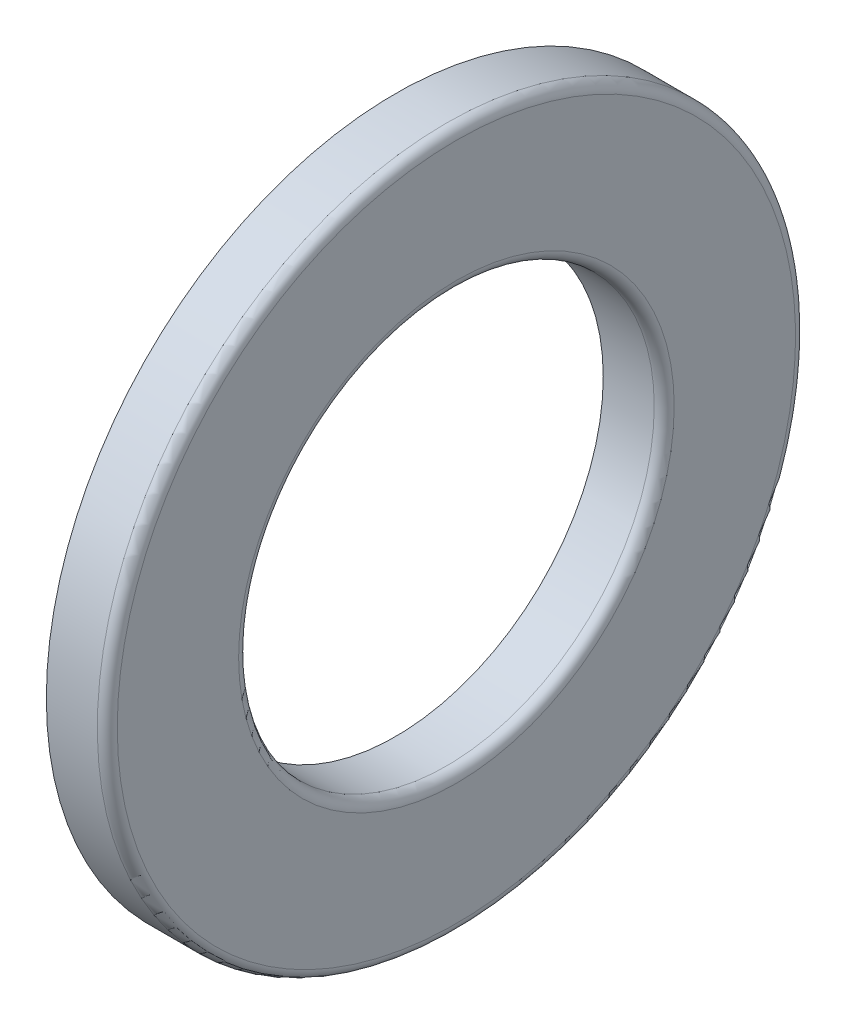
ISO-10303-21;
HEADER;
FILE_DESCRIPTION(('STEP AP214'),'2;1');
FILE_NAME('part.step','',(''),(''),'','','');
FILE_SCHEMA(('AUTOMOTIVE_DESIGN { 1 0 10303 214 1 1 1 1 }'));
ENDSEC;
DATA;
#1=APPLICATION_CONTEXT('core data for automotive mechanical design processes');
#2=APPLICATION_PROTOCOL_DEFINITION('international standard','automotive_design',2000,#1);
#3=PRODUCT_CONTEXT('',#1,'mechanical');
#4=PRODUCT('Part','Part','',(#3));
#5=PRODUCT_RELATED_PRODUCT_CATEGORY('part','',(#4));
#6=PRODUCT_DEFINITION_FORMATION('','',#4);
#7=PRODUCT_DEFINITION_CONTEXT('part definition',#1,'design');
#8=PRODUCT_DEFINITION('design','',#6,#7);
#9=PRODUCT_DEFINITION_SHAPE('','',#8);
#10=(LENGTH_UNIT() NAMED_UNIT(*) SI_UNIT(.MILLI.,.METRE.));
#11=(NAMED_UNIT(*) PLANE_ANGLE_UNIT() SI_UNIT($,.RADIAN.));
#12=(NAMED_UNIT(*) SI_UNIT($,.STERADIAN.) SOLID_ANGLE_UNIT());
#13=UNCERTAINTY_MEASURE_WITH_UNIT(LENGTH_MEASURE(1.E-05),#10,'distance_accuracy_value','');
#14=(GEOMETRIC_REPRESENTATION_CONTEXT(3) GLOBAL_UNCERTAINTY_ASSIGNED_CONTEXT((#13)) GLOBAL_UNIT_ASSIGNED_CONTEXT((#10,
#11,#12)) REPRESENTATION_CONTEXT('',''));
#15=CARTESIAN_POINT('',(0.,0.,0.));
#16=DIRECTION('',(0.,0.,1.));
#17=DIRECTION('',(1.,0.,0.));
#18=AXIS2_PLACEMENT_3D('',#15,#16,#17);
#19=CARTESIAN_POINT('',(5.5,0.,0.));
#20=DIRECTION('',(1.,0.,0.));
#21=DIRECTION('',(0.,1.,0.));
#22=AXIS2_PLACEMENT_3D('',#19,#20,#21);
#23=TOROIDAL_SURFACE('',#22,17.,2.2);
#24=CARTESIAN_POINT('',(7.33333333333333,0.,0.));
#25=DIRECTION('',(1.,0.,0.));
#26=DIRECTION('',(0.,0.,-1.));
#27=AXIS2_PLACEMENT_3D('',#24,#25,#26);
#28=CIRCLE('',#27,15.7839042435364);
#29=CARTESIAN_POINT('',(7.33333333333333,0.,-15.7839042435364));
#30=VERTEX_POINT('',#29);
#31=EDGE_CURVE('E18',#30,#30,#28,.F.);
#32=ORIENTED_EDGE('',*,*,#31,.F.);
#33=EDGE_LOOP('',(#32));
#34=FACE_BOUND('',#33,.T.);
#35=CARTESIAN_POINT('',(7.33333333333333,0.,0.));
#36=DIRECTION('',(1.,0.,0.));
#37=DIRECTION('',(0.,0.,-1.));
#38=AXIS2_PLACEMENT_3D('',#35,#36,#37);
#39=CIRCLE('',#38,18.2160957564636);
#40=CARTESIAN_POINT('',(7.33333333333333,0.,-18.2160957564636));
#41=VERTEX_POINT('',#40);
#42=EDGE_CURVE('E61',#41,#41,#39,.T.);
#43=ORIENTED_EDGE('',*,*,#42,.F.);
#44=EDGE_LOOP('',(#43));
#45=FACE_BOUND('',#44,.T.);
#46=ADVANCED_FACE('F14',(#34,#45),#23,.F.);
#47=CARTESIAN_POINT('',(7.33333333333333,0.,16.75));
#48=DIRECTION('',(-1.,0.,0.));
#49=DIRECTION('',(0.,0.,1.));
#50=AXIS2_PLACEMENT_3D('',#47,#48,#49);
#51=PLANE('',#50);
#52=CARTESIAN_POINT('',(7.33333333333333,0.,0.));
#53=DIRECTION('',(1.,0.,0.));
#54=DIRECTION('',(0.,0.,-1.));
#55=AXIS2_PLACEMENT_3D('',#52,#53,#54);
#56=CIRCLE('',#55,12.50000000005);
#57=CARTESIAN_POINT('',(7.33333333333333,0.,-12.50000000005));
#58=VERTEX_POINT('',#57);
#59=EDGE_CURVE('E59',#58,#58,#56,.F.);
#60=ORIENTED_EDGE('',*,*,#59,.F.);
#61=EDGE_LOOP('',(#60));
#62=FACE_BOUND('',#61,.T.);
#63=ORIENTED_EDGE('',*,*,#31,.T.);
#64=EDGE_LOOP('',(#63));
#65=FACE_BOUND('',#64,.T.);
#66=ADVANCED_FACE('F68',(#62,#65),#51,.T.);
#67=CARTESIAN_POINT('',(7.33333333333333,0.,16.75));
#68=DIRECTION('',(-1.,0.,0.));
#69=DIRECTION('',(0.,0.,1.));
#70=AXIS2_PLACEMENT_3D('',#67,#68,#69);
#71=PLANE('',#70);
#72=CARTESIAN_POINT('',(7.33333333333333,0.,0.));
#73=DIRECTION('',(1.,0.,0.));
#74=DIRECTION('',(0.,0.,-1.));
#75=AXIS2_PLACEMENT_3D('',#72,#73,#74);
#76=CIRCLE('',#75,21.);
#77=CARTESIAN_POINT('',(7.33333333333333,0.,-21.));
#78=VERTEX_POINT('',#77);
#79=EDGE_CURVE('E45',#78,#78,#76,.T.);
#80=ORIENTED_EDGE('',*,*,#79,.F.);
#81=EDGE_LOOP('',(#80));
#82=FACE_BOUND('',#81,.T.);
#83=ORIENTED_EDGE('',*,*,#42,.T.);
#84=EDGE_LOOP('',(#83));
#85=FACE_BOUND('',#84,.T.);
#86=ADVANCED_FACE('F76',(#82,#85),#71,.T.);
#87=CARTESIAN_POINT('',(7.33333333333333,0.,0.));
#88=DIRECTION('',(1.,0.,0.));
#89=DIRECTION('',(0.,0.,-1.));
#90=AXIS2_PLACEMENT_3D('',#87,#88,#89);
#91=CYLINDRICAL_SURFACE('',#90,12.50000000005);
#92=ORIENTED_EDGE('',*,*,#59,.T.);
#93=EDGE_LOOP('',(#92));
#94=FACE_BOUND('',#93,.T.);
#95=CARTESIAN_POINT('',(10.4,0.,0.));
#96=DIRECTION('',(1.,0.,0.));
#97=DIRECTION('',(0.,1.,0.));
#98=AXIS2_PLACEMENT_3D('',#95,#96,#97);
#99=CIRCLE('',#98,12.5000000001);
#100=CARTESIAN_POINT('',(10.4,12.5000000001,0.));
#101=VERTEX_POINT('',#100);
#102=EDGE_CURVE('E39',#101,#101,#99,.F.);
#103=ORIENTED_EDGE('',*,*,#102,.F.);
#104=EDGE_LOOP('',(#103));
#105=FACE_BOUND('',#104,.T.);
#106=ADVANCED_FACE('F122',(#94,#105),#91,.F.);
#107=CARTESIAN_POINT('',(8.86666666666667,0.,0.));
#108=DIRECTION('',(1.,0.,0.));
#109=DIRECTION('',(0.,0.,-1.));
#110=AXIS2_PLACEMENT_3D('',#107,#108,#109);
#111=CYLINDRICAL_SURFACE('',#110,21.);
#112=CARTESIAN_POINT('',(10.3999999997293,0.,0.));
#113=DIRECTION('',(1.,0.,0.));
#114=DIRECTION('',(0.,1.,0.));
#115=AXIS2_PLACEMENT_3D('',#112,#113,#114);
#116=CIRCLE('',#115,21.);
#117=CARTESIAN_POINT('',(10.3999999997293,21.,0.));
#118=VERTEX_POINT('',#117);
#119=EDGE_CURVE('E32',#118,#118,#116,.T.);
#120=ORIENTED_EDGE('',*,*,#119,.F.);
#121=EDGE_LOOP('',(#120));
#122=FACE_BOUND('',#121,.T.);
#123=ORIENTED_EDGE('',*,*,#79,.T.);
#124=EDGE_LOOP('',(#123));
#125=FACE_BOUND('',#124,.T.);
#126=ADVANCED_FACE('F118',(#122,#125),#111,.T.);
#127=CARTESIAN_POINT('',(10.3999999998293,0.,0.));
#128=DIRECTION('',(1.,0.,0.));
#129=DIRECTION('',(0.,1.,0.));
#130=AXIS2_PLACEMENT_3D('',#127,#128,#129);
#131=TOROIDAL_SURFACE('',#130,13.1000000002707,0.600000000170715);
#132=CARTESIAN_POINT('',(11.,0.,0.));
#133=DIRECTION('',(1.,0.,0.));
#134=DIRECTION('',(0.,0.,1.));
#135=AXIS2_PLACEMENT_3D('',#132,#133,#134);
#136=CIRCLE('',#135,13.1);
#137=CARTESIAN_POINT('',(11.,0.,13.1));
#138=VERTEX_POINT('',#137);
#139=EDGE_CURVE('E23',#138,#138,#136,.F.);
#140=ORIENTED_EDGE('',*,*,#139,.F.);
#141=EDGE_LOOP('',(#140));
#142=FACE_BOUND('',#141,.T.);
#143=ORIENTED_EDGE('',*,*,#102,.T.);
#144=EDGE_LOOP('',(#143));
#145=FACE_BOUND('',#144,.T.);
#146=ADVANCED_FACE('F85',(#142,#145),#131,.T.);
#147=CARTESIAN_POINT('',(10.3999999997293,0.,0.));
#148=DIRECTION('',(1.,0.,0.));
#149=DIRECTION('',(0.,1.,0.));
#150=AXIS2_PLACEMENT_3D('',#147,#148,#149);
#151=TOROIDAL_SURFACE('',#150,20.3999999998293,0.600000000170709);
#152=ORIENTED_EDGE('',*,*,#119,.T.);
#153=EDGE_LOOP('',(#152));
#154=FACE_BOUND('',#153,.T.);
#155=CARTESIAN_POINT('',(10.9999999999,0.,0.));
#156=DIRECTION('',(-1.,0.,0.));
#157=DIRECTION('',(0.,0.,1.));
#158=AXIS2_PLACEMENT_3D('',#155,#156,#157);
#159=CIRCLE('',#158,20.4);
#160=CARTESIAN_POINT('',(10.9999999999,0.,20.4));
#161=VERTEX_POINT('',#160);
#162=EDGE_CURVE('E10',#161,#161,#159,.F.);
#163=ORIENTED_EDGE('',*,*,#162,.F.);
#164=EDGE_LOOP('',(#163));
#165=FACE_BOUND('',#164,.T.);
#166=ADVANCED_FACE('F80',(#154,#165),#151,.T.);
#167=CARTESIAN_POINT('',(10.99999999995,0.,16.75));
#168=DIRECTION('',(1.,0.,0.));
#169=DIRECTION('',(0.,1.,0.));
#170=AXIS2_PLACEMENT_3D('',#167,#168,#169);
#171=PLANE('',#170);
#172=ORIENTED_EDGE('',*,*,#162,.T.);
#173=EDGE_LOOP('',(#172));
#174=FACE_BOUND('',#173,.T.);
#175=ORIENTED_EDGE('',*,*,#139,.T.);
#176=EDGE_LOOP('',(#175));
#177=FACE_BOUND('',#176,.T.);
#178=ADVANCED_FACE('F78',(#174,#177),#171,.T.);
#179=CLOSED_SHELL('',(#46,#66,#86,#106,#126,#146,#166,#178));
#180=MANIFOLD_SOLID_BREP('B1',#179);
#181=ADVANCED_BREP_SHAPE_REPRESENTATION('',(#18,#180),#14);
#182=SHAPE_DEFINITION_REPRESENTATION(#9,#181);
ENDSEC;
END-ISO-10303-21;
